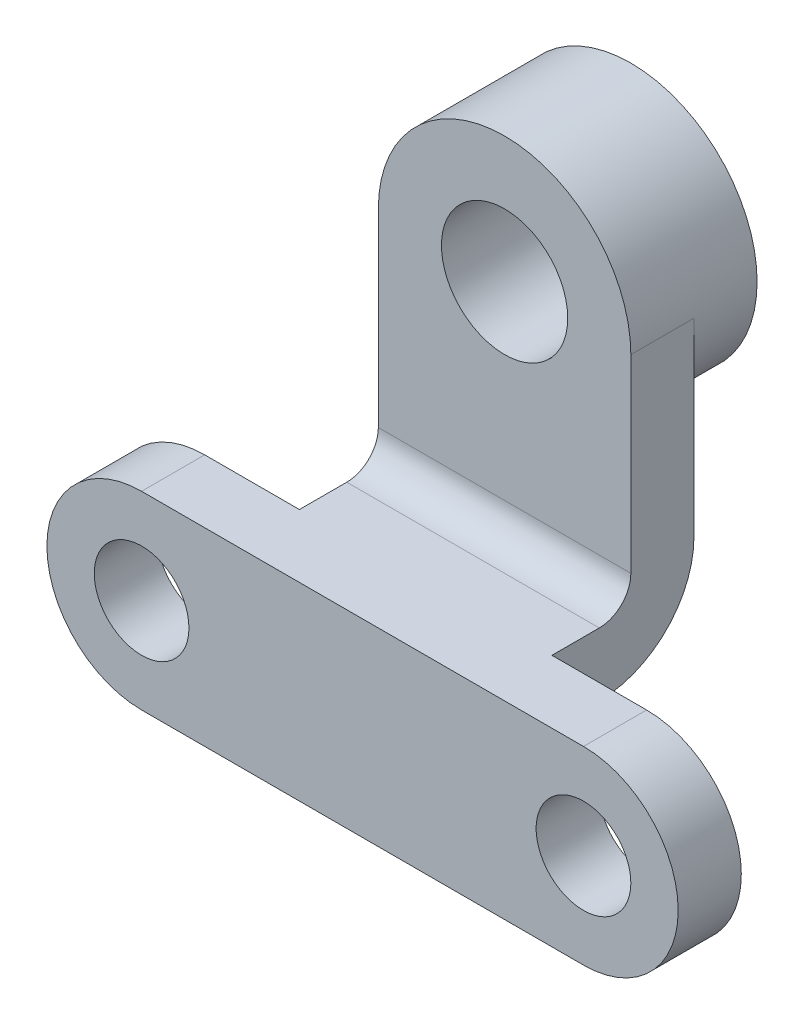
ISO-10303-21;
HEADER;
FILE_DESCRIPTION(('STEP AP214'),'2;1');
FILE_NAME('part.step','',(''),(''),'','','');
FILE_SCHEMA(('AUTOMOTIVE_DESIGN { 1 0 10303 214 1 1 1 1 }'));
ENDSEC;
DATA;
#1=APPLICATION_CONTEXT('core data for automotive mechanical design processes');
#2=APPLICATION_PROTOCOL_DEFINITION('international standard','automotive_design',2000,#1);
#3=PRODUCT_CONTEXT('',#1,'mechanical');
#4=PRODUCT('Part','Part','',(#3));
#5=PRODUCT_RELATED_PRODUCT_CATEGORY('part','',(#4));
#6=PRODUCT_DEFINITION_FORMATION('','',#4);
#7=PRODUCT_DEFINITION_CONTEXT('part definition',#1,'design');
#8=PRODUCT_DEFINITION('design','',#6,#7);
#9=PRODUCT_DEFINITION_SHAPE('','',#8);
#10=(LENGTH_UNIT() NAMED_UNIT(*) SI_UNIT(.MILLI.,.METRE.));
#11=(NAMED_UNIT(*) PLANE_ANGLE_UNIT() SI_UNIT($,.RADIAN.));
#12=(NAMED_UNIT(*) SI_UNIT($,.STERADIAN.) SOLID_ANGLE_UNIT());
#13=UNCERTAINTY_MEASURE_WITH_UNIT(LENGTH_MEASURE(1.E-05),#10,'distance_accuracy_value','');
#14=(GEOMETRIC_REPRESENTATION_CONTEXT(3) GLOBAL_UNCERTAINTY_ASSIGNED_CONTEXT((#13)) GLOBAL_UNIT_ASSIGNED_CONTEXT((#10,
#11,#12)) REPRESENTATION_CONTEXT('',''));
#15=CARTESIAN_POINT('',(0.,0.,0.));
#16=DIRECTION('',(0.,0.,1.));
#17=DIRECTION('',(1.,0.,0.));
#18=AXIS2_PLACEMENT_3D('',#15,#16,#17);
#19=CARTESIAN_POINT('',(-88.9,38.1,-25.4));
#20=DIRECTION('',(0.,1.,0.));
#21=DIRECTION('',(0.,0.,1.));
#22=AXIS2_PLACEMENT_3D('',#19,#20,#21);
#23=PLANE('',#22);
#24=DIRECTION('',(0.,0.,1.));
#25=VECTOR('',#24,1.);
#26=CARTESIAN_POINT('',(50.8,38.1,-82.55));
#27=LINE('',#26,#25);
#28=CARTESIAN_POINT('',(50.8,38.1,-44.45));
#29=VERTEX_POINT('',#28);
#30=CARTESIAN_POINT('',(50.8,38.1,-25.4));
#31=VERTEX_POINT('',#30);
#32=EDGE_CURVE('E173',#29,#31,#27,.T.);
#33=ORIENTED_EDGE('',*,*,#32,.F.);
#34=DIRECTION('',(1.,0.,0.));
#35=VECTOR('',#34,1.);
#36=CARTESIAN_POINT('',(-88.9,38.1,-44.45));
#37=LINE('',#36,#35);
#38=CARTESIAN_POINT('',(-50.8,38.1,-44.45));
#39=VERTEX_POINT('',#38);
#40=EDGE_CURVE('E225',#29,#39,#37,.F.);
#41=ORIENTED_EDGE('',*,*,#40,.T.);
#42=DIRECTION('',(0.,0.,1.));
#43=VECTOR('',#42,1.);
#44=CARTESIAN_POINT('',(-50.8,38.1,-82.55));
#45=LINE('',#44,#43);
#46=CARTESIAN_POINT('',(-50.8,38.1,-25.4));
#47=VERTEX_POINT('',#46);
#48=EDGE_CURVE('E175',#39,#47,#45,.T.);
#49=ORIENTED_EDGE('',*,*,#48,.T.);
#50=DIRECTION('',(-1.,0.,0.));
#51=VECTOR('',#50,1.);
#52=CARTESIAN_POINT('',(-88.9,38.1,-25.4));
#53=LINE('',#52,#51);
#54=CARTESIAN_POINT('',(-88.9,38.1,-25.4));
#55=VERTEX_POINT('',#54);
#56=EDGE_CURVE('E202',#47,#55,#53,.T.);
#57=ORIENTED_EDGE('',*,*,#56,.T.);
#58=DIRECTION('',(0.,0.,1.));
#59=VECTOR('',#58,1.);
#60=CARTESIAN_POINT('',(-88.9,38.1,-25.4));
#61=LINE('',#60,#59);
#62=CARTESIAN_POINT('',(-88.9,38.1,0.));
#63=VERTEX_POINT('',#62);
#64=EDGE_CURVE('E217',#55,#63,#61,.T.);
#65=ORIENTED_EDGE('',*,*,#64,.T.);
#66=DIRECTION('',(-1.,0.,0.));
#67=VECTOR('',#66,1.);
#68=CARTESIAN_POINT('',(-88.9,38.1,0.));
#69=LINE('',#68,#67);
#70=CARTESIAN_POINT('',(88.9,38.1,0.));
#71=VERTEX_POINT('',#70);
#72=EDGE_CURVE('E196',#71,#63,#69,.T.);
#73=ORIENTED_EDGE('',*,*,#72,.F.);
#74=DIRECTION('',(0.,0.,1.));
#75=VECTOR('',#74,1.);
#76=CARTESIAN_POINT('',(88.9,38.1,-25.4));
#77=LINE('',#76,#75);
#78=CARTESIAN_POINT('',(88.9,38.1,-25.4));
#79=VERTEX_POINT('',#78);
#80=EDGE_CURVE('E219',#79,#71,#77,.T.);
#81=ORIENTED_EDGE('',*,*,#80,.F.);
#82=EDGE_CURVE('E203',#79,#31,#53,.T.);
#83=ORIENTED_EDGE('',*,*,#82,.T.);
#84=EDGE_LOOP('',(#33,#41,#49,#57,#65,#73,#81,#83));
#85=FACE_BOUND('',#84,.T.);
#86=ADVANCED_FACE('F33',(#85),#23,.T.);
#87=CARTESIAN_POINT('',(-88.9,0.,-25.4));
#88=DIRECTION('',(0.,0.,1.));
#89=DIRECTION('',(1.,0.,0.));
#90=AXIS2_PLACEMENT_3D('',#87,#88,#89);
#91=PLANE('',#90);
#92=CARTESIAN_POINT('',(-88.9,0.,-25.4));
#93=DIRECTION('',(0.,0.,1.));
#94=DIRECTION('',(1.,0.,0.));
#95=AXIS2_PLACEMENT_3D('',#92,#93,#94);
#96=CIRCLE('',#95,19.05);
#97=CARTESIAN_POINT('',(-69.85,0.,-25.4));
#98=VERTEX_POINT('',#97);
#99=EDGE_CURVE('E186',#98,#98,#96,.T.);
#100=ORIENTED_EDGE('',*,*,#99,.T.);
#101=EDGE_LOOP('',(#100));
#102=FACE_BOUND('',#101,.T.);
#103=CARTESIAN_POINT('',(88.9,0.,-25.4));
#104=DIRECTION('',(0.,0.,1.));
#105=DIRECTION('',(1.,0.,0.));
#106=AXIS2_PLACEMENT_3D('',#103,#104,#105);
#107=CIRCLE('',#106,19.05);
#108=CARTESIAN_POINT('',(107.95,0.,-25.4));
#109=VERTEX_POINT('',#108);
#110=EDGE_CURVE('E180',#109,#109,#107,.T.);
#111=ORIENTED_EDGE('',*,*,#110,.T.);
#112=EDGE_LOOP('',(#111));
#113=FACE_BOUND('',#112,.T.);
#114=DIRECTION('',(0.,-1.,0.));
#115=VECTOR('',#114,1.);
#116=CARTESIAN_POINT('',(50.8,38.1,-25.4));
#117=LINE('',#116,#115);
#118=CARTESIAN_POINT('',(50.8,12.7,-25.4));
#119=VERTEX_POINT('',#118);
#120=EDGE_CURVE('E162',#31,#119,#117,.T.);
#121=ORIENTED_EDGE('',*,*,#120,.F.);
#122=ORIENTED_EDGE('',*,*,#82,.F.);
#123=CARTESIAN_POINT('',(88.9,0.,-25.4));
#124=DIRECTION('',(0.,0.,1.));
#125=DIRECTION('',(1.,0.,0.));
#126=AXIS2_PLACEMENT_3D('',#123,#124,#125);
#127=CIRCLE('',#126,38.1);
#128=CARTESIAN_POINT('',(88.9,-38.1,-25.4));
#129=VERTEX_POINT('',#128);
#130=EDGE_CURVE('E199',#129,#79,#127,.T.);
#131=ORIENTED_EDGE('',*,*,#130,.F.);
#132=DIRECTION('',(1.,0.,0.));
#133=VECTOR('',#132,1.);
#134=CARTESIAN_POINT('',(-88.9,-38.1,-25.4));
#135=LINE('',#134,#133);
#136=CARTESIAN_POINT('',(-88.9,-38.1,-25.4));
#137=VERTEX_POINT('',#136);
#138=EDGE_CURVE('E195',#137,#129,#135,.T.);
#139=ORIENTED_EDGE('',*,*,#138,.F.);
#140=CARTESIAN_POINT('',(-88.9,0.,-25.4));
#141=DIRECTION('',(0.,0.,1.));
#142=DIRECTION('',(1.,0.,0.));
#143=AXIS2_PLACEMENT_3D('',#140,#141,#142);
#144=CIRCLE('',#143,38.1);
#145=EDGE_CURVE('E192',#55,#137,#144,.T.);
#146=ORIENTED_EDGE('',*,*,#145,.F.);
#147=ORIENTED_EDGE('',*,*,#56,.F.);
#148=DIRECTION('',(0.,-1.,0.));
#149=VECTOR('',#148,1.);
#150=CARTESIAN_POINT('',(-50.8,38.1,-25.4));
#151=LINE('',#150,#149);
#152=CARTESIAN_POINT('',(-50.8,12.7,-25.4));
#153=VERTEX_POINT('',#152);
#154=EDGE_CURVE('E167',#47,#153,#151,.T.);
#155=ORIENTED_EDGE('',*,*,#154,.T.);
#156=DIRECTION('',(-1.,0.,0.));
#157=VECTOR('',#156,1.);
#158=CARTESIAN_POINT('',(50.8,12.7,-25.4));
#159=LINE('',#158,#157);
#160=EDGE_CURVE('E159',#119,#153,#159,.T.);
#161=ORIENTED_EDGE('',*,*,#160,.F.);
#162=EDGE_LOOP('',(#121,#122,#131,#139,#146,#147,#155,#161));
#163=FACE_BOUND('',#162,.T.);
#164=ADVANCED_FACE('F252',(#102,#113,#163),#91,.F.);
#165=CARTESIAN_POINT('',(-88.9,0.,-25.4));
#166=DIRECTION('',(0.,0.,1.));
#167=DIRECTION('',(1.,0.,0.));
#168=AXIS2_PLACEMENT_3D('',#165,#166,#167);
#169=CYLINDRICAL_SURFACE('',#168,38.1);
#170=CARTESIAN_POINT('',(-88.9,0.,0.));
#171=DIRECTION('',(0.,0.,1.));
#172=DIRECTION('',(1.,0.,0.));
#173=AXIS2_PLACEMENT_3D('',#170,#171,#172);
#174=CIRCLE('',#173,38.1);
#175=CARTESIAN_POINT('',(-88.9,-38.1,0.));
#176=VERTEX_POINT('',#175);
#177=EDGE_CURVE('E189',#63,#176,#174,.T.);
#178=ORIENTED_EDGE('',*,*,#177,.F.);
#179=ORIENTED_EDGE('',*,*,#64,.F.);
#180=ORIENTED_EDGE('',*,*,#145,.T.);
#181=DIRECTION('',(0.,0.,1.));
#182=VECTOR('',#181,1.);
#183=CARTESIAN_POINT('',(-88.9,-38.1,-25.4));
#184=LINE('',#183,#182);
#185=EDGE_CURVE('E206',#137,#176,#184,.T.);
#186=ORIENTED_EDGE('',*,*,#185,.T.);
#187=EDGE_LOOP('',(#178,#179,#180,#186));
#188=FACE_BOUND('',#187,.T.);
#189=ADVANCED_FACE('F265',(#188),#169,.T.);
#190=CARTESIAN_POINT('',(88.9,0.,-25.4));
#191=DIRECTION('',(0.,0.,1.));
#192=DIRECTION('',(1.,0.,0.));
#193=AXIS2_PLACEMENT_3D('',#190,#191,#192);
#194=CYLINDRICAL_SURFACE('',#193,38.1);
#195=CARTESIAN_POINT('',(88.9,0.,0.));
#196=DIRECTION('',(0.,0.,1.));
#197=DIRECTION('',(1.,0.,0.));
#198=AXIS2_PLACEMENT_3D('',#195,#196,#197);
#199=CIRCLE('',#198,38.1);
#200=CARTESIAN_POINT('',(88.9,-38.1,0.));
#201=VERTEX_POINT('',#200);
#202=EDGE_CURVE('E212',#201,#71,#199,.T.);
#203=ORIENTED_EDGE('',*,*,#202,.F.);
#204=DIRECTION('',(0.,0.,1.));
#205=VECTOR('',#204,1.);
#206=CARTESIAN_POINT('',(88.9,-38.1,-25.4));
#207=LINE('',#206,#205);
#208=EDGE_CURVE('E221',#129,#201,#207,.T.);
#209=ORIENTED_EDGE('',*,*,#208,.F.);
#210=ORIENTED_EDGE('',*,*,#130,.T.);
#211=ORIENTED_EDGE('',*,*,#80,.T.);
#212=EDGE_LOOP('',(#203,#209,#210,#211));
#213=FACE_BOUND('',#212,.T.);
#214=ADVANCED_FACE('F271',(#213),#194,.T.);
#215=CARTESIAN_POINT('',(-88.9,-38.1,-25.4));
#216=DIRECTION('',(0.,-1.,0.));
#217=DIRECTION('',(0.,0.,-1.));
#218=AXIS2_PLACEMENT_3D('',#215,#216,#217);
#219=PLANE('',#218);
#220=DIRECTION('',(1.,0.,0.));
#221=VECTOR('',#220,1.);
#222=CARTESIAN_POINT('',(-88.9,-38.1,0.));
#223=LINE('',#222,#221);
#224=EDGE_CURVE('E209',#176,#201,#223,.T.);
#225=ORIENTED_EDGE('',*,*,#224,.F.);
#226=ORIENTED_EDGE('',*,*,#185,.F.);
#227=ORIENTED_EDGE('',*,*,#138,.T.);
#228=ORIENTED_EDGE('',*,*,#208,.T.);
#229=EDGE_LOOP('',(#225,#226,#227,#228));
#230=FACE_BOUND('',#229,.T.);
#231=ADVANCED_FACE('F274',(#230),#219,.T.);
#232=CARTESIAN_POINT('',(-88.9,0.,0.));
#233=DIRECTION('',(0.,0.,1.));
#234=DIRECTION('',(1.,0.,0.));
#235=AXIS2_PLACEMENT_3D('',#232,#233,#234);
#236=PLANE('',#235);
#237=CARTESIAN_POINT('',(88.9,0.,0.));
#238=DIRECTION('',(0.,0.,1.));
#239=DIRECTION('',(1.,0.,0.));
#240=AXIS2_PLACEMENT_3D('',#237,#238,#239);
#241=CIRCLE('',#240,19.05);
#242=CARTESIAN_POINT('',(107.95,0.,0.));
#243=VERTEX_POINT('',#242);
#244=EDGE_CURVE('E179',#243,#243,#241,.T.);
#245=ORIENTED_EDGE('',*,*,#244,.F.);
#246=EDGE_LOOP('',(#245));
#247=FACE_BOUND('',#246,.T.);
#248=CARTESIAN_POINT('',(-88.9,0.,0.));
#249=DIRECTION('',(0.,0.,1.));
#250=DIRECTION('',(1.,0.,0.));
#251=AXIS2_PLACEMENT_3D('',#248,#249,#250);
#252=CIRCLE('',#251,19.05);
#253=CARTESIAN_POINT('',(-69.85,0.,0.));
#254=VERTEX_POINT('',#253);
#255=EDGE_CURVE('E183',#254,#254,#252,.T.);
#256=ORIENTED_EDGE('',*,*,#255,.F.);
#257=EDGE_LOOP('',(#256));
#258=FACE_BOUND('',#257,.T.);
#259=ORIENTED_EDGE('',*,*,#177,.T.);
#260=ORIENTED_EDGE('',*,*,#224,.T.);
#261=ORIENTED_EDGE('',*,*,#202,.T.);
#262=ORIENTED_EDGE('',*,*,#72,.T.);
#263=EDGE_LOOP('',(#259,#260,#261,#262));
#264=FACE_BOUND('',#263,.T.);
#265=ADVANCED_FACE('F270',(#247,#258,#264),#236,.T.);
#266=CARTESIAN_POINT('',(-88.9,0.,-25.4));
#267=DIRECTION('',(0.,0.,1.));
#268=DIRECTION('',(1.,0.,0.));
#269=AXIS2_PLACEMENT_3D('',#266,#267,#268);
#270=CYLINDRICAL_SURFACE('',#269,19.05);
#271=ORIENTED_EDGE('',*,*,#99,.F.);
#272=EDGE_LOOP('',(#271));
#273=FACE_BOUND('',#272,.T.);
#274=ORIENTED_EDGE('',*,*,#255,.T.);
#275=EDGE_LOOP('',(#274));
#276=FACE_BOUND('',#275,.T.);
#277=ADVANCED_FACE('F300',(#273,#276),#270,.F.);
#278=CARTESIAN_POINT('',(88.9,0.,-25.4));
#279=DIRECTION('',(0.,0.,1.));
#280=DIRECTION('',(1.,0.,0.));
#281=AXIS2_PLACEMENT_3D('',#278,#279,#280);
#282=CYLINDRICAL_SURFACE('',#281,19.05);
#283=ORIENTED_EDGE('',*,*,#110,.F.);
#284=EDGE_LOOP('',(#283));
#285=FACE_BOUND('',#284,.T.);
#286=ORIENTED_EDGE('',*,*,#244,.T.);
#287=EDGE_LOOP('',(#286));
#288=FACE_BOUND('',#287,.T.);
#289=ADVANCED_FACE('F293',(#285,#288),#282,.F.);
#290=CARTESIAN_POINT('',(50.8,12.7,-82.55));
#291=DIRECTION('',(0.,1.,0.));
#292=DIRECTION('',(0.,0.,1.));
#293=AXIS2_PLACEMENT_3D('',#290,#291,#292);
#294=PLANE('',#293);
#295=DIRECTION('',(0.,0.,1.));
#296=VECTOR('',#295,1.);
#297=CARTESIAN_POINT('',(-50.8,12.7,-82.55));
#298=LINE('',#297,#296);
#299=CARTESIAN_POINT('',(-50.8,12.7,-44.45));
#300=VERTEX_POINT('',#299);
#301=EDGE_CURVE('E177',#300,#153,#298,.T.);
#302=ORIENTED_EDGE('',*,*,#301,.F.);
#303=DIRECTION('',(-1.,0.,0.));
#304=VECTOR('',#303,1.);
#305=CARTESIAN_POINT('',(50.8,12.7,-44.45));
#306=LINE('',#305,#304);
#307=CARTESIAN_POINT('',(50.8,12.7,-44.45));
#308=VERTEX_POINT('',#307);
#309=EDGE_CURVE('E41',#300,#308,#306,.F.);
#310=ORIENTED_EDGE('',*,*,#309,.T.);
#311=DIRECTION('',(0.,0.,1.));
#312=VECTOR('',#311,1.);
#313=CARTESIAN_POINT('',(50.8,12.7,-82.55));
#314=LINE('',#313,#312);
#315=EDGE_CURVE('E164',#308,#119,#314,.T.);
#316=ORIENTED_EDGE('',*,*,#315,.T.);
#317=ORIENTED_EDGE('',*,*,#160,.T.);
#318=EDGE_LOOP('',(#302,#310,#316,#317));
#319=FACE_BOUND('',#318,.T.);
#320=ADVANCED_FACE('F291',(#319),#294,.F.);
#321=CARTESIAN_POINT('',(-50.8,38.1,-82.55));
#322=DIRECTION('',(-1.,0.,0.));
#323=DIRECTION('',(0.,0.,1.));
#324=AXIS2_PLACEMENT_3D('',#321,#322,#323);
#325=PLANE('',#324);
#326=DIRECTION('',(0.,-1.,0.));
#327=VECTOR('',#326,1.);
#328=CARTESIAN_POINT('',(-50.8,38.1,-82.55));
#329=LINE('',#328,#327);
#330=CARTESIAN_POINT('',(-50.8,127.,-82.55));
#331=VERTEX_POINT('',#330);
#332=CARTESIAN_POINT('',(-50.8,50.8,-82.55));
#333=VERTEX_POINT('',#332);
#334=EDGE_CURVE('E160',#331,#333,#329,.T.);
#335=ORIENTED_EDGE('',*,*,#334,.T.);
#336=CARTESIAN_POINT('',(-50.8,50.8,-44.45));
#337=DIRECTION('',(-1.,0.,0.));
#338=DIRECTION('',(0.,0.,1.));
#339=AXIS2_PLACEMENT_3D('',#336,#337,#338);
#340=CIRCLE('',#339,38.1);
#341=EDGE_CURVE('E55',#333,#300,#340,.T.);
#342=ORIENTED_EDGE('',*,*,#341,.T.);
#343=ORIENTED_EDGE('',*,*,#301,.T.);
#344=ORIENTED_EDGE('',*,*,#154,.F.);
#345=ORIENTED_EDGE('',*,*,#48,.F.);
#346=CARTESIAN_POINT('',(-50.8,50.8,-44.45));
#347=DIRECTION('',(-1.,0.,0.));
#348=DIRECTION('',(0.,0.,1.));
#349=AXIS2_PLACEMENT_3D('',#346,#347,#348);
#350=CIRCLE('',#349,12.7);
#351=CARTESIAN_POINT('',(-50.8,50.8,-57.15));
#352=VERTEX_POINT('',#351);
#353=EDGE_CURVE('E229',#39,#352,#350,.F.);
#354=ORIENTED_EDGE('',*,*,#353,.T.);
#355=DIRECTION('',(0.,-1.,0.));
#356=VECTOR('',#355,1.);
#357=CARTESIAN_POINT('',(-50.8,127.,-57.15));
#358=LINE('',#357,#356);
#359=CARTESIAN_POINT('',(-50.8,127.,-57.15));
#360=VERTEX_POINT('',#359);
#361=EDGE_CURVE('E140',#360,#352,#358,.T.);
#362=ORIENTED_EDGE('',*,*,#361,.F.);
#363=DIRECTION('',(0.,0.,1.));
#364=VECTOR('',#363,1.);
#365=CARTESIAN_POINT('',(-50.8,127.,-82.55));
#366=LINE('',#365,#364);
#367=EDGE_CURVE('E130',#331,#360,#366,.T.);
#368=ORIENTED_EDGE('',*,*,#367,.F.);
#369=EDGE_LOOP('',(#335,#342,#343,#344,#345,#354,#362,#368));
#370=FACE_BOUND('',#369,.T.);
#371=ADVANCED_FACE('F239',(#370),#325,.T.);
#372=CARTESIAN_POINT('',(50.8,38.1,-82.55));
#373=DIRECTION('',(-1.,0.,0.));
#374=DIRECTION('',(0.,0.,1.));
#375=AXIS2_PLACEMENT_3D('',#372,#373,#374);
#376=PLANE('',#375);
#377=ORIENTED_EDGE('',*,*,#315,.F.);
#378=CARTESIAN_POINT('',(50.8,50.8,-44.45));
#379=DIRECTION('',(-1.,0.,0.));
#380=DIRECTION('',(0.,0.,1.));
#381=AXIS2_PLACEMENT_3D('',#378,#379,#380);
#382=CIRCLE('',#381,38.1);
#383=CARTESIAN_POINT('',(50.8,50.8,-82.55));
#384=VERTEX_POINT('',#383);
#385=EDGE_CURVE('E11',#308,#384,#382,.F.);
#386=ORIENTED_EDGE('',*,*,#385,.T.);
#387=DIRECTION('',(0.,-1.,0.));
#388=VECTOR('',#387,1.);
#389=CARTESIAN_POINT('',(50.8,38.1,-82.55));
#390=LINE('',#389,#388);
#391=CARTESIAN_POINT('',(50.8,127.,-82.55));
#392=VERTEX_POINT('',#391);
#393=EDGE_CURVE('E126',#392,#384,#390,.T.);
#394=ORIENTED_EDGE('',*,*,#393,.F.);
#395=DIRECTION('',(0.,0.,-1.));
#396=VECTOR('',#395,1.);
#397=CARTESIAN_POINT('',(50.8,127.,-82.55));
#398=LINE('',#397,#396);
#399=CARTESIAN_POINT('',(50.8,127.,-57.15));
#400=VERTEX_POINT('',#399);
#401=EDGE_CURVE('E121',#400,#392,#398,.T.);
#402=ORIENTED_EDGE('',*,*,#401,.F.);
#403=DIRECTION('',(0.,-1.,0.));
#404=VECTOR('',#403,1.);
#405=CARTESIAN_POINT('',(50.8,127.,-57.15));
#406=LINE('',#405,#404);
#407=CARTESIAN_POINT('',(50.8,50.8,-57.15));
#408=VERTEX_POINT('',#407);
#409=EDGE_CURVE('E124',#400,#408,#406,.T.);
#410=ORIENTED_EDGE('',*,*,#409,.T.);
#411=CARTESIAN_POINT('',(50.8,50.8,-44.45));
#412=DIRECTION('',(-1.,0.,0.));
#413=DIRECTION('',(0.,0.,1.));
#414=AXIS2_PLACEMENT_3D('',#411,#412,#413);
#415=CIRCLE('',#414,12.7);
#416=EDGE_CURVE('E227',#408,#29,#415,.T.);
#417=ORIENTED_EDGE('',*,*,#416,.T.);
#418=ORIENTED_EDGE('',*,*,#32,.T.);
#419=ORIENTED_EDGE('',*,*,#120,.T.);
#420=EDGE_LOOP('',(#377,#386,#394,#402,#410,#417,#418,#419));
#421=FACE_BOUND('',#420,.T.);
#422=ADVANCED_FACE('F123',(#421),#376,.F.);
#423=CARTESIAN_POINT('',(0.,0.,-82.55));
#424=DIRECTION('',(0.,0.,1.));
#425=DIRECTION('',(1.,0.,0.));
#426=AXIS2_PLACEMENT_3D('',#423,#424,#425);
#427=PLANE('',#426);
#428=ORIENTED_EDGE('',*,*,#393,.T.);
#429=DIRECTION('',(-1.,0.,0.));
#430=VECTOR('',#429,1.);
#431=CARTESIAN_POINT('',(0.,50.8,-82.55));
#432=LINE('',#431,#430);
#433=EDGE_CURVE('E231',#384,#333,#432,.T.);
#434=ORIENTED_EDGE('',*,*,#433,.T.);
#435=ORIENTED_EDGE('',*,*,#334,.F.);
#436=CARTESIAN_POINT('',(0.,127.,-82.55));
#437=DIRECTION('',(0.,0.,1.));
#438=DIRECTION('',(1.,0.,0.));
#439=AXIS2_PLACEMENT_3D('',#436,#437,#438);
#440=CIRCLE('',#439,50.8);
#441=EDGE_CURVE('E149',#331,#392,#440,.T.);
#442=ORIENTED_EDGE('',*,*,#441,.T.);
#443=EDGE_LOOP('',(#428,#434,#435,#442));
#444=FACE_BOUND('',#443,.T.);
#445=ADVANCED_FACE('F236',(#444),#427,.F.);
#446=CARTESIAN_POINT('',(-50.8,127.,-57.15));
#447=DIRECTION('',(0.,0.,-1.));
#448=DIRECTION('',(-1.,0.,0.));
#449=AXIS2_PLACEMENT_3D('',#446,#447,#448);
#450=PLANE('',#449);
#451=CARTESIAN_POINT('',(0.,127.,-57.15));
#452=DIRECTION('',(0.,0.,1.));
#453=DIRECTION('',(1.,0.,0.));
#454=AXIS2_PLACEMENT_3D('',#451,#452,#453);
#455=CIRCLE('',#454,25.4);
#456=CARTESIAN_POINT('',(25.4,127.,-57.15));
#457=VERTEX_POINT('',#456);
#458=EDGE_CURVE('E152',#457,#457,#455,.T.);
#459=ORIENTED_EDGE('',*,*,#458,.F.);
#460=EDGE_LOOP('',(#459));
#461=FACE_BOUND('',#460,.T.);
#462=ORIENTED_EDGE('',*,*,#361,.T.);
#463=DIRECTION('',(1.,0.,0.));
#464=VECTOR('',#463,1.);
#465=CARTESIAN_POINT('',(-50.8,50.8,-57.15));
#466=LINE('',#465,#464);
#467=EDGE_CURVE('E139',#352,#408,#466,.T.);
#468=ORIENTED_EDGE('',*,*,#467,.T.);
#469=ORIENTED_EDGE('',*,*,#409,.F.);
#470=CARTESIAN_POINT('',(0.,127.,-57.15));
#471=DIRECTION('',(0.,0.,1.));
#472=DIRECTION('',(1.,0.,0.));
#473=AXIS2_PLACEMENT_3D('',#470,#471,#472);
#474=CIRCLE('',#473,50.8);
#475=EDGE_CURVE('E137',#400,#360,#474,.T.);
#476=ORIENTED_EDGE('',*,*,#475,.T.);
#477=EDGE_LOOP('',(#462,#468,#469,#476));
#478=FACE_BOUND('',#477,.T.);
#479=ADVANCED_FACE('F136',(#461,#478),#450,.F.);
#480=CARTESIAN_POINT('',(0.,127.,-107.95));
#481=DIRECTION('',(0.,0.,1.));
#482=DIRECTION('',(1.,0.,0.));
#483=AXIS2_PLACEMENT_3D('',#480,#481,#482);
#484=CYLINDRICAL_SURFACE('',#483,50.8);
#485=CARTESIAN_POINT('',(0.,127.,-107.95));
#486=DIRECTION('',(0.,0.,1.));
#487=DIRECTION('',(1.,0.,0.));
#488=AXIS2_PLACEMENT_3D('',#485,#486,#487);
#489=CIRCLE('',#488,50.8);
#490=CARTESIAN_POINT('',(50.8,127.,-107.95));
#491=VERTEX_POINT('',#490);
#492=EDGE_CURVE('E145',#491,#491,#489,.T.);
#493=ORIENTED_EDGE('',*,*,#492,.T.);
#494=EDGE_LOOP('',(#493));
#495=FACE_BOUND('',#494,.T.);
#496=ORIENTED_EDGE('',*,*,#441,.F.);
#497=ORIENTED_EDGE('',*,*,#367,.T.);
#498=ORIENTED_EDGE('',*,*,#475,.F.);
#499=ORIENTED_EDGE('',*,*,#401,.T.);
#500=EDGE_LOOP('',(#496,#497,#498,#499));
#501=FACE_BOUND('',#500,.T.);
#502=ADVANCED_FACE('F143',(#495,#501),#484,.T.);
#503=CARTESIAN_POINT('',(0.,127.,-107.95));
#504=DIRECTION('',(0.,0.,1.));
#505=DIRECTION('',(1.,0.,0.));
#506=AXIS2_PLACEMENT_3D('',#503,#504,#505);
#507=PLANE('',#506);
#508=CARTESIAN_POINT('',(0.,127.,-107.95));
#509=DIRECTION('',(0.,0.,1.));
#510=DIRECTION('',(1.,0.,0.));
#511=AXIS2_PLACEMENT_3D('',#508,#509,#510);
#512=CIRCLE('',#511,25.4);
#513=CARTESIAN_POINT('',(25.4,127.,-107.95));
#514=VERTEX_POINT('',#513);
#515=EDGE_CURVE('E146',#514,#514,#512,.T.);
#516=ORIENTED_EDGE('',*,*,#515,.T.);
#517=EDGE_LOOP('',(#516));
#518=FACE_BOUND('',#517,.T.);
#519=ORIENTED_EDGE('',*,*,#492,.F.);
#520=EDGE_LOOP('',(#519));
#521=FACE_BOUND('',#520,.T.);
#522=ADVANCED_FACE('F417',(#518,#521),#507,.F.);
#523=CARTESIAN_POINT('',(0.,127.,-107.95));
#524=DIRECTION('',(0.,0.,1.));
#525=DIRECTION('',(1.,0.,0.));
#526=AXIS2_PLACEMENT_3D('',#523,#524,#525);
#527=CYLINDRICAL_SURFACE('',#526,25.4);
#528=ORIENTED_EDGE('',*,*,#515,.F.);
#529=EDGE_LOOP('',(#528));
#530=FACE_BOUND('',#529,.T.);
#531=ORIENTED_EDGE('',*,*,#458,.T.);
#532=EDGE_LOOP('',(#531));
#533=FACE_BOUND('',#532,.T.);
#534=ADVANCED_FACE('F259',(#530,#533),#527,.F.);
#535=CARTESIAN_POINT('',(-50.8,50.8,-44.45));
#536=DIRECTION('',(1.,0.,0.));
#537=DIRECTION('',(0.,0.,-1.));
#538=AXIS2_PLACEMENT_3D('',#535,#536,#537);
#539=CYLINDRICAL_SURFACE('',#538,12.7);
#540=ORIENTED_EDGE('',*,*,#353,.F.);
#541=ORIENTED_EDGE('',*,*,#40,.F.);
#542=ORIENTED_EDGE('',*,*,#416,.F.);
#543=ORIENTED_EDGE('',*,*,#467,.F.);
#544=EDGE_LOOP('',(#540,#541,#542,#543));
#545=FACE_BOUND('',#544,.T.);
#546=ADVANCED_FACE('F243',(#545),#539,.F.);
#547=CARTESIAN_POINT('',(0.,50.8,-44.45));
#548=DIRECTION('',(-1.,0.,0.));
#549=DIRECTION('',(0.,0.,1.));
#550=AXIS2_PLACEMENT_3D('',#547,#548,#549);
#551=CYLINDRICAL_SURFACE('',#550,38.1);
#552=ORIENTED_EDGE('',*,*,#385,.F.);
#553=ORIENTED_EDGE('',*,*,#309,.F.);
#554=ORIENTED_EDGE('',*,*,#341,.F.);
#555=ORIENTED_EDGE('',*,*,#433,.F.);
#556=EDGE_LOOP('',(#552,#553,#554,#555));
#557=FACE_BOUND('',#556,.T.);
#558=ADVANCED_FACE('F35',(#557),#551,.T.);
#559=CLOSED_SHELL('',(#86,#164,#189,#214,#231,#265,#277,#289,#320,#371,#422,#445,#479,#502,#522,
#534,#546,#558));
#560=MANIFOLD_SOLID_BREP('B2',#559);
#561=ADVANCED_BREP_SHAPE_REPRESENTATION('',(#18,#560),#14);
#562=SHAPE_DEFINITION_REPRESENTATION(#9,#561);
ENDSEC;
END-ISO-10303-21;
